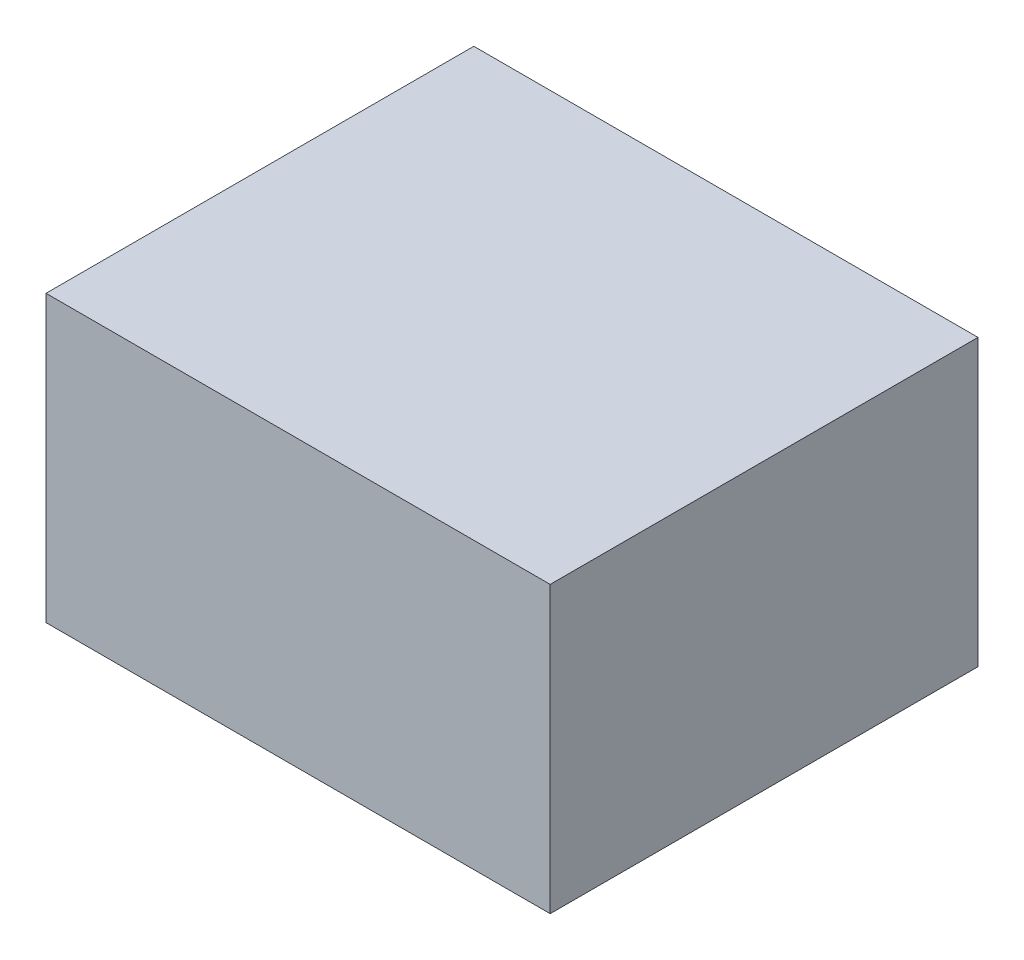
ISO-10303-21;
HEADER;
FILE_DESCRIPTION(('STEP AP214'),'2;1');
FILE_NAME('part.step','',(''),(''),'','','');
FILE_SCHEMA(('AUTOMOTIVE_DESIGN { 1 0 10303 214 1 1 1 1 }'));
ENDSEC;
DATA;
#1=APPLICATION_CONTEXT('core data for automotive mechanical design processes');
#2=APPLICATION_PROTOCOL_DEFINITION('international standard','automotive_design',2000,#1);
#3=PRODUCT_CONTEXT('',#1,'mechanical');
#4=PRODUCT('Part','Part','',(#3));
#5=PRODUCT_RELATED_PRODUCT_CATEGORY('part','',(#4));
#6=PRODUCT_DEFINITION_FORMATION('','',#4);
#7=PRODUCT_DEFINITION_CONTEXT('part definition',#1,'design');
#8=PRODUCT_DEFINITION('design','',#6,#7);
#9=PRODUCT_DEFINITION_SHAPE('','',#8);
#10=(LENGTH_UNIT() NAMED_UNIT(*) SI_UNIT(.MILLI.,.METRE.));
#11=(NAMED_UNIT(*) PLANE_ANGLE_UNIT() SI_UNIT($,.RADIAN.));
#12=(NAMED_UNIT(*) SI_UNIT($,.STERADIAN.) SOLID_ANGLE_UNIT());
#13=UNCERTAINTY_MEASURE_WITH_UNIT(LENGTH_MEASURE(1.E-05),#10,'distance_accuracy_value','');
#14=(GEOMETRIC_REPRESENTATION_CONTEXT(3) GLOBAL_UNCERTAINTY_ASSIGNED_CONTEXT((#13)) GLOBAL_UNIT_ASSIGNED_CONTEXT((#10,
#11,#12)) REPRESENTATION_CONTEXT('',''));
#15=CARTESIAN_POINT('',(0.,0.,0.));
#16=DIRECTION('',(0.,0.,1.));
#17=DIRECTION('',(1.,0.,0.));
#18=AXIS2_PLACEMENT_3D('',#15,#16,#17);
#19=CARTESIAN_POINT('',(0.,0.,4.65));
#20=DIRECTION('',(0.,0.,1.));
#21=DIRECTION('',(1.,0.,0.));
#22=AXIS2_PLACEMENT_3D('',#19,#20,#21);
#23=PLANE('',#22);
#24=DIRECTION('',(1.,0.,0.));
#25=VECTOR('',#24,1.);
#26=CARTESIAN_POINT('',(-2.74,-1.55,4.65));
#27=LINE('',#26,#25);
#28=CARTESIAN_POINT('',(-2.74,-1.55,4.65));
#29=VERTEX_POINT('',#28);
#30=CARTESIAN_POINT('',(2.74,-1.55,4.65));
#31=VERTEX_POINT('',#30);
#32=EDGE_CURVE('E83',#29,#31,#27,.T.);
#33=ORIENTED_EDGE('',*,*,#32,.T.);
#34=DIRECTION('',(0.,1.,0.));
#35=VECTOR('',#34,1.);
#36=CARTESIAN_POINT('',(2.74,-1.55,4.65));
#37=LINE('',#36,#35);
#38=CARTESIAN_POINT('',(2.74,1.55,4.65));
#39=VERTEX_POINT('',#38);
#40=EDGE_CURVE('E106',#31,#39,#37,.T.);
#41=ORIENTED_EDGE('',*,*,#40,.T.);
#42=DIRECTION('',(-1.,0.,0.));
#43=VECTOR('',#42,1.);
#44=CARTESIAN_POINT('',(2.74,1.55,4.65));
#45=LINE('',#44,#43);
#46=CARTESIAN_POINT('',(-2.74,1.55,4.65));
#47=VERTEX_POINT('',#46);
#48=EDGE_CURVE('E75',#39,#47,#45,.T.);
#49=ORIENTED_EDGE('',*,*,#48,.T.);
#50=DIRECTION('',(0.,-1.,0.));
#51=VECTOR('',#50,1.);
#52=CARTESIAN_POINT('',(-2.74,1.55,4.65));
#53=LINE('',#52,#51);
#54=EDGE_CURVE('E11',#47,#29,#53,.T.);
#55=ORIENTED_EDGE('',*,*,#54,.T.);
#56=EDGE_LOOP('',(#33,#41,#49,#55));
#57=FACE_BOUND('',#56,.T.);
#58=ADVANCED_FACE('F17',(#57),#23,.T.);
#59=CARTESIAN_POINT('',(0.,0.,0.));
#60=DIRECTION('',(0.,0.,1.));
#61=DIRECTION('',(1.,0.,0.));
#62=AXIS2_PLACEMENT_3D('',#59,#60,#61);
#63=PLANE('',#62);
#64=DIRECTION('',(0.,-1.,0.));
#65=VECTOR('',#64,1.);
#66=CARTESIAN_POINT('',(-2.74,1.55,0.));
#67=LINE('',#66,#65);
#68=CARTESIAN_POINT('',(-2.74,1.55,0.));
#69=VERTEX_POINT('',#68);
#70=CARTESIAN_POINT('',(-2.74,-1.55,0.));
#71=VERTEX_POINT('',#70);
#72=EDGE_CURVE('E26',#69,#71,#67,.T.);
#73=ORIENTED_EDGE('',*,*,#72,.F.);
#74=DIRECTION('',(-1.,0.,0.));
#75=VECTOR('',#74,1.);
#76=CARTESIAN_POINT('',(2.74,1.55,0.));
#77=LINE('',#76,#75);
#78=CARTESIAN_POINT('',(2.74,1.55,0.));
#79=VERTEX_POINT('',#78);
#80=EDGE_CURVE('E109',#79,#69,#77,.T.);
#81=ORIENTED_EDGE('',*,*,#80,.F.);
#82=DIRECTION('',(0.,1.,0.));
#83=VECTOR('',#82,1.);
#84=CARTESIAN_POINT('',(2.74,-1.55,0.));
#85=LINE('',#84,#83);
#86=CARTESIAN_POINT('',(2.74,-1.55,0.));
#87=VERTEX_POINT('',#86);
#88=EDGE_CURVE('E85',#87,#79,#85,.T.);
#89=ORIENTED_EDGE('',*,*,#88,.F.);
#90=DIRECTION('',(1.,0.,0.));
#91=VECTOR('',#90,1.);
#92=CARTESIAN_POINT('',(-2.74,-1.55,0.));
#93=LINE('',#92,#91);
#94=EDGE_CURVE('E81',#71,#87,#93,.T.);
#95=ORIENTED_EDGE('',*,*,#94,.F.);
#96=EDGE_LOOP('',(#73,#81,#89,#95));
#97=FACE_BOUND('',#96,.T.);
#98=ADVANCED_FACE('F87',(#97),#63,.F.);
#99=CARTESIAN_POINT('',(-2.74,1.55,0.));
#100=DIRECTION('',(1.,0.,0.));
#101=DIRECTION('',(0.,1.,0.));
#102=AXIS2_PLACEMENT_3D('',#99,#100,#101);
#103=PLANE('',#102);
#104=ORIENTED_EDGE('',*,*,#72,.T.);
#105=DIRECTION('',(0.,0.,1.));
#106=VECTOR('',#105,1.);
#107=CARTESIAN_POINT('',(-2.74,-1.55,0.));
#108=LINE('',#107,#106);
#109=EDGE_CURVE('E70',#71,#29,#108,.T.);
#110=ORIENTED_EDGE('',*,*,#109,.T.);
#111=ORIENTED_EDGE('',*,*,#54,.F.);
#112=DIRECTION('',(0.,0.,1.));
#113=VECTOR('',#112,1.);
#114=CARTESIAN_POINT('',(-2.74,1.55,0.));
#115=LINE('',#114,#113);
#116=EDGE_CURVE('E20',#69,#47,#115,.T.);
#117=ORIENTED_EDGE('',*,*,#116,.F.);
#118=EDGE_LOOP('',(#104,#110,#111,#117));
#119=FACE_BOUND('',#118,.T.);
#120=ADVANCED_FACE('F69',(#119),#103,.F.);
#121=CARTESIAN_POINT('',(2.74,1.55,0.));
#122=DIRECTION('',(0.,-1.,0.));
#123=DIRECTION('',(0.,0.,-1.));
#124=AXIS2_PLACEMENT_3D('',#121,#122,#123);
#125=PLANE('',#124);
#126=ORIENTED_EDGE('',*,*,#80,.T.);
#127=ORIENTED_EDGE('',*,*,#116,.T.);
#128=ORIENTED_EDGE('',*,*,#48,.F.);
#129=DIRECTION('',(0.,0.,1.));
#130=VECTOR('',#129,1.);
#131=CARTESIAN_POINT('',(2.74,1.55,0.));
#132=LINE('',#131,#130);
#133=EDGE_CURVE('E102',#79,#39,#132,.T.);
#134=ORIENTED_EDGE('',*,*,#133,.F.);
#135=EDGE_LOOP('',(#126,#127,#128,#134));
#136=FACE_BOUND('',#135,.T.);
#137=ADVANCED_FACE('F120',(#136),#125,.F.);
#138=CARTESIAN_POINT('',(2.74,-1.55,0.));
#139=DIRECTION('',(-1.,0.,0.));
#140=DIRECTION('',(0.,0.,1.));
#141=AXIS2_PLACEMENT_3D('',#138,#139,#140);
#142=PLANE('',#141);
#143=ORIENTED_EDGE('',*,*,#88,.T.);
#144=ORIENTED_EDGE('',*,*,#133,.T.);
#145=ORIENTED_EDGE('',*,*,#40,.F.);
#146=DIRECTION('',(0.,0.,1.));
#147=VECTOR('',#146,1.);
#148=CARTESIAN_POINT('',(2.74,-1.55,0.));
#149=LINE('',#148,#147);
#150=EDGE_CURVE('E91',#87,#31,#149,.T.);
#151=ORIENTED_EDGE('',*,*,#150,.F.);
#152=EDGE_LOOP('',(#143,#144,#145,#151));
#153=FACE_BOUND('',#152,.T.);
#154=ADVANCED_FACE('F122',(#153),#142,.F.);
#155=CARTESIAN_POINT('',(-2.74,-1.55,0.));
#156=DIRECTION('',(0.,1.,0.));
#157=DIRECTION('',(1.,0.,0.));
#158=AXIS2_PLACEMENT_3D('',#155,#156,#157);
#159=PLANE('',#158);
#160=ORIENTED_EDGE('',*,*,#94,.T.);
#161=ORIENTED_EDGE('',*,*,#150,.T.);
#162=ORIENTED_EDGE('',*,*,#32,.F.);
#163=ORIENTED_EDGE('',*,*,#109,.F.);
#164=EDGE_LOOP('',(#160,#161,#162,#163));
#165=FACE_BOUND('',#164,.T.);
#166=ADVANCED_FACE('F79',(#165),#159,.F.);
#167=CLOSED_SHELL('',(#58,#98,#120,#137,#154,#166));
#168=MANIFOLD_SOLID_BREP('B1',#167);
#169=ADVANCED_BREP_SHAPE_REPRESENTATION('',(#18,#168),#14);
#170=SHAPE_DEFINITION_REPRESENTATION(#9,#169);
ENDSEC;
END-ISO-10303-21;
